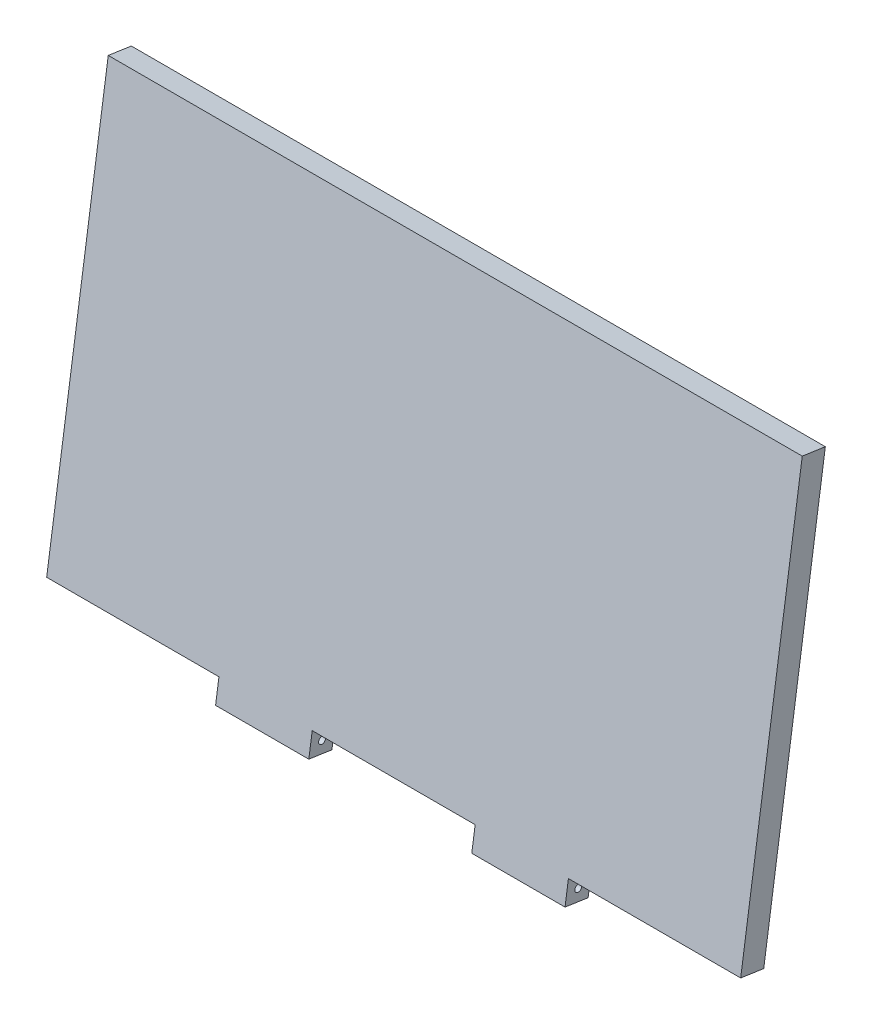
ISO-10303-21;
HEADER;
FILE_DESCRIPTION(('STEP AP214'),'2;1');
FILE_NAME('part.step','',(''),(''),'','','');
FILE_SCHEMA(('AUTOMOTIVE_DESIGN { 1 0 10303 214 1 1 1 1 }'));
ENDSEC;
DATA;
#1=APPLICATION_CONTEXT('core data for automotive mechanical design processes');
#2=APPLICATION_PROTOCOL_DEFINITION('international standard','automotive_design',2000,#1);
#3=PRODUCT_CONTEXT('',#1,'mechanical');
#4=PRODUCT('Part','Part','',(#3));
#5=PRODUCT_RELATED_PRODUCT_CATEGORY('part','',(#4));
#6=PRODUCT_DEFINITION_FORMATION('','',#4);
#7=PRODUCT_DEFINITION_CONTEXT('part definition',#1,'design');
#8=PRODUCT_DEFINITION('design','',#6,#7);
#9=PRODUCT_DEFINITION_SHAPE('','',#8);
#10=(LENGTH_UNIT() NAMED_UNIT(*) SI_UNIT(.MILLI.,.METRE.));
#11=(NAMED_UNIT(*) PLANE_ANGLE_UNIT() SI_UNIT($,.RADIAN.));
#12=(NAMED_UNIT(*) SI_UNIT($,.STERADIAN.) SOLID_ANGLE_UNIT());
#13=UNCERTAINTY_MEASURE_WITH_UNIT(LENGTH_MEASURE(1.E-05),#10,'distance_accuracy_value','');
#14=(GEOMETRIC_REPRESENTATION_CONTEXT(3) GLOBAL_UNCERTAINTY_ASSIGNED_CONTEXT((#13)) GLOBAL_UNIT_ASSIGNED_CONTEXT((#10,
#11,#12)) REPRESENTATION_CONTEXT('',''));
#15=CARTESIAN_POINT('',(0.,0.,0.));
#16=DIRECTION('',(0.,0.,1.));
#17=DIRECTION('',(1.,0.,0.));
#18=AXIS2_PLACEMENT_3D('',#15,#16,#17);
#19=CARTESIAN_POINT('',(-64.4822007420279,-93.5866931497724,179.851110920545));
#20=DIRECTION('',(1.,0.,0.));
#21=DIRECTION('',(0.,0.,-1.));
#22=AXIS2_PLACEMENT_3D('',#19,#20,#21);
#23=PLANE('',#22);
#24=DIRECTION('',(0.,-0.989483426541347,0.144646287888747));
#25=VECTOR('',#24,1.);
#26=CARTESIAN_POINT('',(-64.4822007420279,-95.4237010059595,167.284671403469));
#27=LINE('',#26,#25);
#28=CARTESIAN_POINT('',(-64.4822007420279,133.960265353528,133.752488503678));
#29=VERTEX_POINT('',#28);
#30=CARTESIAN_POINT('',(-64.4822007420279,-95.4237010059595,167.284671403469));
#31=VERTEX_POINT('',#30);
#32=EDGE_CURVE('E159',#29,#31,#27,.T.);
#33=ORIENTED_EDGE('',*,*,#32,.T.);
#34=DIRECTION('',(0.,-0.144646287888747,-0.989483426541347));
#35=VECTOR('',#34,1.);
#36=CARTESIAN_POINT('',(-64.4822007420279,-93.5866931497724,179.851110920545));
#37=LINE('',#36,#35);
#38=CARTESIAN_POINT('',(-64.4822007420279,-93.5866931497724,179.851110920545));
#39=VERTEX_POINT('',#38);
#40=EDGE_CURVE('E11',#39,#31,#37,.T.);
#41=ORIENTED_EDGE('',*,*,#40,.F.);
#42=DIRECTION('',(0.,-0.989483426541347,0.144646287888747));
#43=VECTOR('',#42,1.);
#44=CARTESIAN_POINT('',(-64.4822007420279,-93.5866931497724,179.851110920545));
#45=LINE('',#44,#43);
#46=CARTESIAN_POINT('',(-64.4822007420279,135.797273209715,146.318928020753));
#47=VERTEX_POINT('',#46);
#48=EDGE_CURVE('E182',#47,#39,#45,.T.);
#49=ORIENTED_EDGE('',*,*,#48,.F.);
#50=DIRECTION('',(0.,-0.144646287888747,-0.989483426541347));
#51=VECTOR('',#50,1.);
#52=CARTESIAN_POINT('',(-64.4822007420279,135.797273209715,146.318928020753));
#53=LINE('',#52,#51);
#54=EDGE_CURVE('E155',#47,#29,#53,.T.);
#55=ORIENTED_EDGE('',*,*,#54,.T.);
#56=EDGE_LOOP('',(#33,#41,#49,#55));
#57=FACE_BOUND('',#56,.T.);
#58=ADVANCED_FACE('F39',(#57),#23,.F.);
#59=CARTESIAN_POINT('',(-64.4822007420279,-93.5866931497724,179.851110920545));
#60=DIRECTION('',(0.,0.989483426541347,-0.144646287888747));
#61=DIRECTION('',(0.,0.144646287888747,0.989483426541347));
#62=AXIS2_PLACEMENT_3D('',#59,#60,#61);
#63=PLANE('',#62);
#64=DIRECTION('',(1.,0.,0.));
#65=VECTOR('',#64,1.);
#66=CARTESIAN_POINT('',(-64.4822007420279,-95.4237010059595,167.284671403469));
#67=LINE('',#66,#65);
#68=CARTESIAN_POINT('',(29.3377992579718,-95.4237010059595,167.284671403469));
#69=VERTEX_POINT('',#68);
#70=EDGE_CURVE('E162',#31,#69,#67,.T.);
#71=ORIENTED_EDGE('',*,*,#70,.T.);
#72=DIRECTION('',(0.,-0.144646287888747,-0.989483426541347));
#73=VECTOR('',#72,1.);
#74=CARTESIAN_POINT('',(29.3377992579718,-93.5866931497724,179.851110920545));
#75=LINE('',#74,#73);
#76=CARTESIAN_POINT('',(29.3377992579718,-93.5866931497724,179.851110920545));
#77=VERTEX_POINT('',#76);
#78=EDGE_CURVE('E47',#77,#69,#75,.T.);
#79=ORIENTED_EDGE('',*,*,#78,.F.);
#80=DIRECTION('',(1.,0.,0.));
#81=VECTOR('',#80,1.);
#82=CARTESIAN_POINT('',(-64.4822007420279,-93.5866931497724,179.851110920545));
#83=LINE('',#82,#81);
#84=EDGE_CURVE('E110',#39,#77,#83,.T.);
#85=ORIENTED_EDGE('',*,*,#84,.F.);
#86=ORIENTED_EDGE('',*,*,#40,.T.);
#87=EDGE_LOOP('',(#71,#79,#85,#86));
#88=FACE_BOUND('',#87,.T.);
#89=ADVANCED_FACE('F260',(#88),#63,.F.);
#90=CARTESIAN_POINT('',(29.3377992579718,-93.5866931497724,179.851110920545));
#91=DIRECTION('',(1.,0.,0.));
#92=DIRECTION('',(0.,0.,-1.));
#93=AXIS2_PLACEMENT_3D('',#90,#91,#92);
#94=PLANE('',#93);
#95=CARTESIAN_POINT('',(29.3377992579718,-100.788416836403,174.486395090101));
#96=DIRECTION('',(-1.,0.,0.));
#97=DIRECTION('',(0.,0.,1.));
#98=AXIS2_PLACEMENT_3D('',#95,#96,#97);
#99=CIRCLE('',#98,1.90499999774049);
#100=CARTESIAN_POINT('',(29.3377992579718,-100.788416836403,176.391395087841));
#101=VERTEX_POINT('',#100);
#102=EDGE_CURVE('E342',#101,#101,#99,.T.);
#103=ORIENTED_EDGE('',*,*,#102,.F.);
#104=EDGE_LOOP('',(#103));
#105=FACE_BOUND('',#104,.T.);
#106=DIRECTION('',(0.,-0.989483426541347,0.144646287888748));
#107=VECTOR('',#106,1.);
#108=CARTESIAN_POINT('',(29.3377992579718,-95.4237010059595,167.284671403469));
#109=LINE('',#108,#107);
#110=CARTESIAN_POINT('',(29.3377992579718,-107.990140523035,169.121679259657));
#111=VERTEX_POINT('',#110);
#112=EDGE_CURVE('E165',#69,#111,#109,.T.);
#113=ORIENTED_EDGE('',*,*,#112,.T.);
#114=DIRECTION('',(0.,-0.144646287888747,-0.989483426541347));
#115=VECTOR('',#114,1.);
#116=CARTESIAN_POINT('',(29.3377992579718,-106.153132666848,181.688118776732));
#117=LINE('',#116,#115);
#118=CARTESIAN_POINT('',(29.3377992579718,-106.153132666848,181.688118776732));
#119=VERTEX_POINT('',#118);
#120=EDGE_CURVE('E201',#119,#111,#117,.T.);
#121=ORIENTED_EDGE('',*,*,#120,.F.);
#122=DIRECTION('',(0.,-0.989483426541347,0.144646287888748));
#123=VECTOR('',#122,1.);
#124=CARTESIAN_POINT('',(29.3377992579718,-93.5866931497724,179.851110920545));
#125=LINE('',#124,#123);
#126=EDGE_CURVE('E209',#77,#119,#125,.T.);
#127=ORIENTED_EDGE('',*,*,#126,.F.);
#128=ORIENTED_EDGE('',*,*,#78,.T.);
#129=EDGE_LOOP('',(#113,#121,#127,#128));
#130=FACE_BOUND('',#129,.T.);
#131=ADVANCED_FACE('F207',(#105,#130),#94,.F.);
#132=CARTESIAN_POINT('',(29.3377992579718,-106.153132666848,181.688118776732));
#133=DIRECTION('',(0.,0.989483426541347,-0.144646287888747));
#134=DIRECTION('',(0.,0.144646287888747,0.989483426541347));
#135=AXIS2_PLACEMENT_3D('',#132,#133,#134);
#136=PLANE('',#135);
#137=DIRECTION('',(1.,0.,0.));
#138=VECTOR('',#137,1.);
#139=CARTESIAN_POINT('',(29.3377992579718,-107.990140523035,169.121679259657));
#140=LINE('',#139,#138);
#141=CARTESIAN_POINT('',(80.1377992579722,-107.990140523035,169.121679259657));
#142=VERTEX_POINT('',#141);
#143=EDGE_CURVE('E167',#111,#142,#140,.T.);
#144=ORIENTED_EDGE('',*,*,#143,.T.);
#145=DIRECTION('',(0.,-0.144646287888747,-0.989483426541347));
#146=VECTOR('',#145,1.);
#147=CARTESIAN_POINT('',(80.1377992579722,-106.153132666848,181.688118776732));
#148=LINE('',#147,#146);
#149=CARTESIAN_POINT('',(80.1377992579722,-106.153132666848,181.688118776732));
#150=VERTEX_POINT('',#149);
#151=EDGE_CURVE('E198',#150,#142,#148,.T.);
#152=ORIENTED_EDGE('',*,*,#151,.F.);
#153=DIRECTION('',(1.,0.,0.));
#154=VECTOR('',#153,1.);
#155=CARTESIAN_POINT('',(29.3377992579718,-106.153132666848,181.688118776732));
#156=LINE('',#155,#154);
#157=EDGE_CURVE('E227',#119,#150,#156,.T.);
#158=ORIENTED_EDGE('',*,*,#157,.F.);
#159=ORIENTED_EDGE('',*,*,#120,.T.);
#160=EDGE_LOOP('',(#144,#152,#158,#159));
#161=FACE_BOUND('',#160,.T.);
#162=ADVANCED_FACE('F218',(#161),#136,.F.);
#163=CARTESIAN_POINT('',(80.1377992579722,-106.153132666848,181.688118776732));
#164=DIRECTION('',(-1.,0.,0.));
#165=DIRECTION('',(0.,0.,1.));
#166=AXIS2_PLACEMENT_3D('',#163,#164,#165);
#167=PLANE('',#166);
#168=CARTESIAN_POINT('',(80.1377992579722,-100.788416836403,174.486395090101));
#169=DIRECTION('',(-1.,0.,0.));
#170=DIRECTION('',(0.,0.,1.));
#171=AXIS2_PLACEMENT_3D('',#168,#169,#170);
#172=CIRCLE('',#171,1.90499999774049);
#173=CARTESIAN_POINT('',(80.1377992579722,-100.788416836403,176.391395087841));
#174=VERTEX_POINT('',#173);
#175=EDGE_CURVE('E163',#174,#174,#172,.T.);
#176=ORIENTED_EDGE('',*,*,#175,.T.);
#177=EDGE_LOOP('',(#176));
#178=FACE_BOUND('',#177,.T.);
#179=DIRECTION('',(0.,0.989483426541347,-0.144646287888748));
#180=VECTOR('',#179,1.);
#181=CARTESIAN_POINT('',(80.1377992579722,-107.990140523035,169.121679259657));
#182=LINE('',#181,#180);
#183=CARTESIAN_POINT('',(80.1377992579722,-95.4237010059595,167.284671403469));
#184=VERTEX_POINT('',#183);
#185=EDGE_CURVE('E169',#142,#184,#182,.T.);
#186=ORIENTED_EDGE('',*,*,#185,.T.);
#187=DIRECTION('',(0.,-0.144646287888747,-0.989483426541347));
#188=VECTOR('',#187,1.);
#189=CARTESIAN_POINT('',(80.1377992579722,-93.5866931497724,179.851110920545));
#190=LINE('',#189,#188);
#191=CARTESIAN_POINT('',(80.1377992579722,-93.5866931497724,179.851110920545));
#192=VERTEX_POINT('',#191);
#193=EDGE_CURVE('E195',#192,#184,#190,.T.);
#194=ORIENTED_EDGE('',*,*,#193,.F.);
#195=DIRECTION('',(0.,0.989483426541347,-0.144646287888748));
#196=VECTOR('',#195,1.);
#197=CARTESIAN_POINT('',(80.1377992579722,-106.153132666848,181.688118776732));
#198=LINE('',#197,#196);
#199=EDGE_CURVE('E224',#150,#192,#198,.T.);
#200=ORIENTED_EDGE('',*,*,#199,.F.);
#201=ORIENTED_EDGE('',*,*,#151,.T.);
#202=EDGE_LOOP('',(#186,#194,#200,#201));
#203=FACE_BOUND('',#202,.T.);
#204=ADVANCED_FACE('F222',(#178,#203),#167,.F.);
#205=CARTESIAN_POINT('',(80.1377992579722,-93.5866931497724,179.851110920545));
#206=DIRECTION('',(0.,0.989483426541347,-0.144646287888747));
#207=DIRECTION('',(0.,0.144646287888747,0.989483426541347));
#208=AXIS2_PLACEMENT_3D('',#205,#206,#207);
#209=PLANE('',#208);
#210=DIRECTION('',(1.,0.,0.));
#211=VECTOR('',#210,1.);
#212=CARTESIAN_POINT('',(80.1377992579722,-95.4237010059595,167.284671403469));
#213=LINE('',#212,#211);
#214=CARTESIAN_POINT('',(168.877799257972,-95.4237010059595,167.284671403469));
#215=VERTEX_POINT('',#214);
#216=EDGE_CURVE('E171',#184,#215,#213,.T.);
#217=ORIENTED_EDGE('',*,*,#216,.T.);
#218=DIRECTION('',(0.,-0.144646287888747,-0.989483426541347));
#219=VECTOR('',#218,1.);
#220=CARTESIAN_POINT('',(168.877799257972,-93.5866931497724,179.851110920545));
#221=LINE('',#220,#219);
#222=CARTESIAN_POINT('',(168.877799257972,-93.5866931497724,179.851110920545));
#223=VERTEX_POINT('',#222);
#224=EDGE_CURVE('E192',#223,#215,#221,.T.);
#225=ORIENTED_EDGE('',*,*,#224,.F.);
#226=DIRECTION('',(1.,0.,0.));
#227=VECTOR('',#226,1.);
#228=CARTESIAN_POINT('',(80.1377992579722,-93.5866931497724,179.851110920545));
#229=LINE('',#228,#227);
#230=EDGE_CURVE('E226',#192,#223,#229,.T.);
#231=ORIENTED_EDGE('',*,*,#230,.F.);
#232=ORIENTED_EDGE('',*,*,#193,.T.);
#233=EDGE_LOOP('',(#217,#225,#231,#232));
#234=FACE_BOUND('',#233,.T.);
#235=ADVANCED_FACE('F274',(#234),#209,.F.);
#236=CARTESIAN_POINT('',(168.877799257972,-93.5866931497724,179.851110920545));
#237=DIRECTION('',(1.,0.,0.));
#238=DIRECTION('',(0.,0.,-1.));
#239=AXIS2_PLACEMENT_3D('',#236,#237,#238);
#240=PLANE('',#239);
#241=CARTESIAN_POINT('',(168.877799257972,-100.788416836403,174.486395090101));
#242=DIRECTION('',(1.,0.,0.));
#243=DIRECTION('',(0.,0.,-1.));
#244=AXIS2_PLACEMENT_3D('',#241,#242,#243);
#245=CIRCLE('',#244,1.90499999774049);
#246=CARTESIAN_POINT('',(168.877799257972,-100.788416836403,172.58139509236));
#247=VERTEX_POINT('',#246);
#248=EDGE_CURVE('E345',#247,#247,#245,.T.);
#249=ORIENTED_EDGE('',*,*,#248,.T.);
#250=EDGE_LOOP('',(#249));
#251=FACE_BOUND('',#250,.T.);
#252=DIRECTION('',(0.,-0.989483426541347,0.144646287888748));
#253=VECTOR('',#252,1.);
#254=CARTESIAN_POINT('',(168.877799257972,-95.4237010059595,167.284671403469));
#255=LINE('',#254,#253);
#256=CARTESIAN_POINT('',(168.877799257972,-107.990140523035,169.121679259657));
#257=VERTEX_POINT('',#256);
#258=EDGE_CURVE('E173',#215,#257,#255,.T.);
#259=ORIENTED_EDGE('',*,*,#258,.T.);
#260=DIRECTION('',(0.,-0.144646287888747,-0.989483426541347));
#261=VECTOR('',#260,1.);
#262=CARTESIAN_POINT('',(168.877799257972,-106.153132666848,181.688118776732));
#263=LINE('',#262,#261);
#264=CARTESIAN_POINT('',(168.877799257972,-106.153132666848,181.688118776732));
#265=VERTEX_POINT('',#264);
#266=EDGE_CURVE('E189',#265,#257,#263,.T.);
#267=ORIENTED_EDGE('',*,*,#266,.F.);
#268=DIRECTION('',(0.,-0.989483426541347,0.144646287888748));
#269=VECTOR('',#268,1.);
#270=CARTESIAN_POINT('',(168.877799257972,-93.5866931497724,179.851110920545));
#271=LINE('',#270,#269);
#272=EDGE_CURVE('E229',#223,#265,#271,.T.);
#273=ORIENTED_EDGE('',*,*,#272,.F.);
#274=ORIENTED_EDGE('',*,*,#224,.T.);
#275=EDGE_LOOP('',(#259,#267,#273,#274));
#276=FACE_BOUND('',#275,.T.);
#277=ADVANCED_FACE('F278',(#251,#276),#240,.F.);
#278=CARTESIAN_POINT('',(168.877799257972,-106.153132666848,181.688118776732));
#279=DIRECTION('',(0.,0.989483426541347,-0.144646287888747));
#280=DIRECTION('',(0.,0.144646287888747,0.989483426541347));
#281=AXIS2_PLACEMENT_3D('',#278,#279,#280);
#282=PLANE('',#281);
#283=DIRECTION('',(1.,0.,0.));
#284=VECTOR('',#283,1.);
#285=CARTESIAN_POINT('',(168.877799257972,-107.990140523035,169.121679259657));
#286=LINE('',#285,#284);
#287=CARTESIAN_POINT('',(219.677799257972,-107.990140523035,169.121679259657));
#288=VERTEX_POINT('',#287);
#289=EDGE_CURVE('E175',#257,#288,#286,.T.);
#290=ORIENTED_EDGE('',*,*,#289,.T.);
#291=DIRECTION('',(0.,-0.144646287888747,-0.989483426541347));
#292=VECTOR('',#291,1.);
#293=CARTESIAN_POINT('',(219.677799257972,-106.153132666848,181.688118776732));
#294=LINE('',#293,#292);
#295=CARTESIAN_POINT('',(219.677799257972,-106.153132666848,181.688118776732));
#296=VERTEX_POINT('',#295);
#297=EDGE_CURVE('E186',#296,#288,#294,.T.);
#298=ORIENTED_EDGE('',*,*,#297,.F.);
#299=DIRECTION('',(1.,0.,0.));
#300=VECTOR('',#299,1.);
#301=CARTESIAN_POINT('',(168.877799257972,-106.153132666848,181.688118776732));
#302=LINE('',#301,#300);
#303=EDGE_CURVE('E235',#265,#296,#302,.T.);
#304=ORIENTED_EDGE('',*,*,#303,.F.);
#305=ORIENTED_EDGE('',*,*,#266,.T.);
#306=EDGE_LOOP('',(#290,#298,#304,#305));
#307=FACE_BOUND('',#306,.T.);
#308=ADVANCED_FACE('F241',(#307),#282,.F.);
#309=CARTESIAN_POINT('',(219.677799257972,-106.153132666848,181.688118776732));
#310=DIRECTION('',(-1.,0.,0.));
#311=DIRECTION('',(0.,0.,1.));
#312=AXIS2_PLACEMENT_3D('',#309,#310,#311);
#313=PLANE('',#312);
#314=CARTESIAN_POINT('',(219.677799257972,-100.788416836403,174.486395090101));
#315=DIRECTION('',(-1.,0.,0.));
#316=DIRECTION('',(0.,0.,1.));
#317=AXIS2_PLACEMENT_3D('',#314,#315,#316);
#318=CIRCLE('',#317,1.90499999774049);
#319=CARTESIAN_POINT('',(219.677799257972,-100.788416836403,176.391395087841));
#320=VERTEX_POINT('',#319);
#321=EDGE_CURVE('E348',#320,#320,#318,.F.);
#322=ORIENTED_EDGE('',*,*,#321,.F.);
#323=EDGE_LOOP('',(#322));
#324=FACE_BOUND('',#323,.T.);
#325=DIRECTION('',(0.,0.989483426541347,-0.144646287888748));
#326=VECTOR('',#325,1.);
#327=CARTESIAN_POINT('',(219.677799257972,-107.990140523035,169.121679259657));
#328=LINE('',#327,#326);
#329=CARTESIAN_POINT('',(219.677799257972,-95.4237010059595,167.284671403469));
#330=VERTEX_POINT('',#329);
#331=EDGE_CURVE('E177',#288,#330,#328,.T.);
#332=ORIENTED_EDGE('',*,*,#331,.T.);
#333=DIRECTION('',(0.,-0.144646287888747,-0.989483426541347));
#334=VECTOR('',#333,1.);
#335=CARTESIAN_POINT('',(219.677799257972,-93.5866931497724,179.851110920545));
#336=LINE('',#335,#334);
#337=CARTESIAN_POINT('',(219.677799257972,-93.5866931497724,179.851110920545));
#338=VERTEX_POINT('',#337);
#339=EDGE_CURVE('E150',#338,#330,#336,.T.);
#340=ORIENTED_EDGE('',*,*,#339,.F.);
#341=DIRECTION('',(0.,0.989483426541347,-0.144646287888748));
#342=VECTOR('',#341,1.);
#343=CARTESIAN_POINT('',(219.677799257972,-106.153132666848,181.688118776732));
#344=LINE('',#343,#342);
#345=EDGE_CURVE('E141',#296,#338,#344,.T.);
#346=ORIENTED_EDGE('',*,*,#345,.F.);
#347=ORIENTED_EDGE('',*,*,#297,.T.);
#348=EDGE_LOOP('',(#332,#340,#346,#347));
#349=FACE_BOUND('',#348,.T.);
#350=ADVANCED_FACE('F245',(#324,#349),#313,.F.);
#351=CARTESIAN_POINT('',(219.677799257972,-93.5866931497724,179.851110920545));
#352=DIRECTION('',(0.,0.989483426541347,-0.144646287888747));
#353=DIRECTION('',(0.,0.144646287888747,0.989483426541347));
#354=AXIS2_PLACEMENT_3D('',#351,#352,#353);
#355=PLANE('',#354);
#356=DIRECTION('',(1.,0.,0.));
#357=VECTOR('',#356,1.);
#358=CARTESIAN_POINT('',(219.677799257972,-95.4237010059595,167.284671403469));
#359=LINE('',#358,#357);
#360=CARTESIAN_POINT('',(313.497799257972,-95.4237010059595,167.284671403469));
#361=VERTEX_POINT('',#360);
#362=EDGE_CURVE('E149',#330,#361,#359,.T.);
#363=ORIENTED_EDGE('',*,*,#362,.T.);
#364=DIRECTION('',(0.,-0.144646287888747,-0.989483426541347));
#365=VECTOR('',#364,1.);
#366=CARTESIAN_POINT('',(313.497799257972,-93.5866931497724,179.851110920545));
#367=LINE('',#366,#365);
#368=CARTESIAN_POINT('',(313.497799257972,-93.5866931497724,179.851110920545));
#369=VERTEX_POINT('',#368);
#370=EDGE_CURVE('E146',#369,#361,#367,.T.);
#371=ORIENTED_EDGE('',*,*,#370,.F.);
#372=DIRECTION('',(1.,0.,0.));
#373=VECTOR('',#372,1.);
#374=CARTESIAN_POINT('',(219.677799257972,-93.5866931497724,179.851110920545));
#375=LINE('',#374,#373);
#376=EDGE_CURVE('E135',#338,#369,#375,.T.);
#377=ORIENTED_EDGE('',*,*,#376,.F.);
#378=ORIENTED_EDGE('',*,*,#339,.T.);
#379=EDGE_LOOP('',(#363,#371,#377,#378));
#380=FACE_BOUND('',#379,.T.);
#381=ADVANCED_FACE('F147',(#380),#355,.F.);
#382=CARTESIAN_POINT('',(313.497799257972,-93.5866931497724,179.851110920545));
#383=DIRECTION('',(-1.,0.,0.));
#384=DIRECTION('',(0.,0.,1.));
#385=AXIS2_PLACEMENT_3D('',#382,#383,#384);
#386=PLANE('',#385);
#387=DIRECTION('',(0.,0.989483426541347,-0.144646287888747));
#388=VECTOR('',#387,1.);
#389=CARTESIAN_POINT('',(313.497799257972,-95.4237010059595,167.284671403469));
#390=LINE('',#389,#388);
#391=CARTESIAN_POINT('',(313.497799257972,133.960265353528,133.752488503678));
#392=VERTEX_POINT('',#391);
#393=EDGE_CURVE('E96',#361,#392,#390,.T.);
#394=ORIENTED_EDGE('',*,*,#393,.T.);
#395=DIRECTION('',(0.,-0.144646287888747,-0.989483426541347));
#396=VECTOR('',#395,1.);
#397=CARTESIAN_POINT('',(313.497799257972,135.797273209715,146.318928020753));
#398=LINE('',#397,#396);
#399=CARTESIAN_POINT('',(313.497799257972,135.797273209715,146.318928020753));
#400=VERTEX_POINT('',#399);
#401=EDGE_CURVE('E151',#400,#392,#398,.T.);
#402=ORIENTED_EDGE('',*,*,#401,.F.);
#403=DIRECTION('',(0.,0.989483426541347,-0.144646287888747));
#404=VECTOR('',#403,1.);
#405=CARTESIAN_POINT('',(313.497799257972,-93.5866931497724,179.851110920545));
#406=LINE('',#405,#404);
#407=EDGE_CURVE('E139',#369,#400,#406,.T.);
#408=ORIENTED_EDGE('',*,*,#407,.F.);
#409=ORIENTED_EDGE('',*,*,#370,.T.);
#410=EDGE_LOOP('',(#394,#402,#408,#409));
#411=FACE_BOUND('',#410,.T.);
#412=ADVANCED_FACE('F153',(#411),#386,.F.);
#413=CARTESIAN_POINT('',(313.497799257972,135.797273209715,146.318928020753));
#414=DIRECTION('',(0.,-0.989483426541347,0.144646287888747));
#415=DIRECTION('',(0.,-0.144646287888747,-0.989483426541347));
#416=AXIS2_PLACEMENT_3D('',#413,#414,#415);
#417=PLANE('',#416);
#418=DIRECTION('',(-1.,0.,0.));
#419=VECTOR('',#418,1.);
#420=CARTESIAN_POINT('',(313.497799257972,133.960265353528,133.752488503678));
#421=LINE('',#420,#419);
#422=EDGE_CURVE('E102',#392,#29,#421,.T.);
#423=ORIENTED_EDGE('',*,*,#422,.T.);
#424=ORIENTED_EDGE('',*,*,#54,.F.);
#425=DIRECTION('',(-1.,0.,0.));
#426=VECTOR('',#425,1.);
#427=CARTESIAN_POINT('',(313.497799257972,135.797273209715,146.318928020753));
#428=LINE('',#427,#426);
#429=EDGE_CURVE('E55',#400,#47,#428,.T.);
#430=ORIENTED_EDGE('',*,*,#429,.F.);
#431=ORIENTED_EDGE('',*,*,#401,.T.);
#432=EDGE_LOOP('',(#423,#424,#430,#431));
#433=FACE_BOUND('',#432,.T.);
#434=ADVANCED_FACE('F249',(#433),#417,.F.);
#435=CARTESIAN_POINT('',(0.,23.7831369229897,162.693562067503));
#436=DIRECTION('',(0.,0.144646287888747,0.989483426541347));
#437=DIRECTION('',(0.,-0.989483426541347,0.144646287888747));
#438=AXIS2_PLACEMENT_3D('',#435,#436,#437);
#439=PLANE('',#438);
#440=ORIENTED_EDGE('',*,*,#48,.T.);
#441=ORIENTED_EDGE('',*,*,#84,.T.);
#442=ORIENTED_EDGE('',*,*,#126,.T.);
#443=ORIENTED_EDGE('',*,*,#157,.T.);
#444=ORIENTED_EDGE('',*,*,#199,.T.);
#445=ORIENTED_EDGE('',*,*,#230,.T.);
#446=ORIENTED_EDGE('',*,*,#272,.T.);
#447=ORIENTED_EDGE('',*,*,#303,.T.);
#448=ORIENTED_EDGE('',*,*,#345,.T.);
#449=ORIENTED_EDGE('',*,*,#376,.T.);
#450=ORIENTED_EDGE('',*,*,#407,.T.);
#451=ORIENTED_EDGE('',*,*,#429,.T.);
#452=EDGE_LOOP('',(#440,#441,#442,#443,#444,#445,#446,#447,#448,#449,#450,#451));
#453=FACE_BOUND('',#452,.T.);
#454=ADVANCED_FACE('F137',(#453),#439,.T.);
#455=CARTESIAN_POINT('',(0.,21.9461290668026,150.127122550428));
#456=DIRECTION('',(0.,0.144646287888747,0.989483426541347));
#457=DIRECTION('',(0.,-0.989483426541347,0.144646287888747));
#458=AXIS2_PLACEMENT_3D('',#455,#456,#457);
#459=PLANE('',#458);
#460=ORIENTED_EDGE('',*,*,#32,.F.);
#461=ORIENTED_EDGE('',*,*,#422,.F.);
#462=ORIENTED_EDGE('',*,*,#393,.F.);
#463=ORIENTED_EDGE('',*,*,#362,.F.);
#464=ORIENTED_EDGE('',*,*,#331,.F.);
#465=ORIENTED_EDGE('',*,*,#289,.F.);
#466=ORIENTED_EDGE('',*,*,#258,.F.);
#467=ORIENTED_EDGE('',*,*,#216,.F.);
#468=ORIENTED_EDGE('',*,*,#185,.F.);
#469=ORIENTED_EDGE('',*,*,#143,.F.);
#470=ORIENTED_EDGE('',*,*,#112,.F.);
#471=ORIENTED_EDGE('',*,*,#70,.F.);
#472=EDGE_LOOP('',(#460,#461,#462,#463,#464,#465,#466,#467,#468,#469,#470,#471));
#473=FACE_BOUND('',#472,.T.);
#474=ADVANCED_FACE('F213',(#473),#459,.F.);
#475=CARTESIAN_POINT('',(225.065952924223,-100.788416836403,174.486395090101));
#476=DIRECTION('',(-1.,0.,0.));
#477=DIRECTION('',(0.,0.,1.));
#478=AXIS2_PLACEMENT_3D('',#475,#476,#477);
#479=CYLINDRICAL_SURFACE('',#478,1.90499999774049);
#480=ORIENTED_EDGE('',*,*,#321,.T.);
#481=EDGE_LOOP('',(#480));
#482=FACE_BOUND('',#481,.T.);
#483=ORIENTED_EDGE('',*,*,#248,.F.);
#484=EDGE_LOOP('',(#483));
#485=FACE_BOUND('',#484,.T.);
#486=ADVANCED_FACE('F319',(#482,#485),#479,.F.);
#487=ORIENTED_EDGE('',*,*,#102,.T.);
#488=EDGE_LOOP('',(#487));
#489=FACE_BOUND('',#488,.T.);
#490=ORIENTED_EDGE('',*,*,#175,.F.);
#491=EDGE_LOOP('',(#490));
#492=FACE_BOUND('',#491,.T.);
#493=ADVANCED_FACE('F327',(#489,#492),#479,.F.);
#494=CLOSED_SHELL('',(#58,#89,#131,#162,#204,#235,#277,#308,#350,#381,#412,#434,#454,#474,#486,#493));
#495=MANIFOLD_SOLID_BREP('B2',#494);
#496=ADVANCED_BREP_SHAPE_REPRESENTATION('',(#18,#495),#14);
#497=SHAPE_DEFINITION_REPRESENTATION(#9,#496);
ENDSEC;
END-ISO-10303-21;
